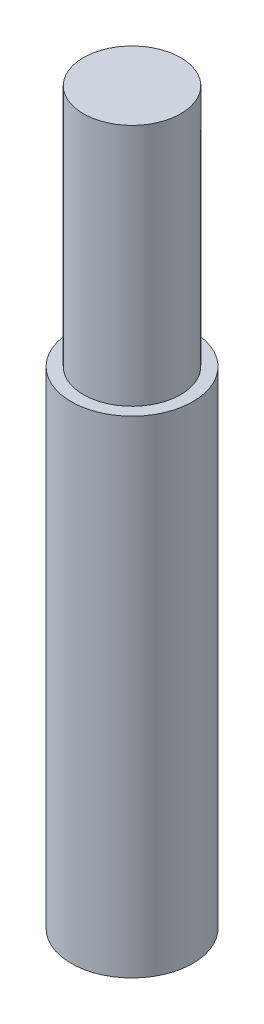
ISO-10303-21;
HEADER;
FILE_DESCRIPTION(('STEP AP214'),'2;1');
FILE_NAME('part.step','',(''),(''),'','','');
FILE_SCHEMA(('AUTOMOTIVE_DESIGN { 1 0 10303 214 1 1 1 1 }'));
ENDSEC;
DATA;
#1=APPLICATION_CONTEXT('core data for automotive mechanical design processes');
#2=APPLICATION_PROTOCOL_DEFINITION('international standard','automotive_design',2000,#1);
#3=PRODUCT_CONTEXT('',#1,'mechanical');
#4=PRODUCT('Part','Part','',(#3));
#5=PRODUCT_RELATED_PRODUCT_CATEGORY('part','',(#4));
#6=PRODUCT_DEFINITION_FORMATION('','',#4);
#7=PRODUCT_DEFINITION_CONTEXT('part definition',#1,'design');
#8=PRODUCT_DEFINITION('design','',#6,#7);
#9=PRODUCT_DEFINITION_SHAPE('','',#8);
#10=(LENGTH_UNIT() NAMED_UNIT(*) SI_UNIT(.MILLI.,.METRE.));
#11=(NAMED_UNIT(*) PLANE_ANGLE_UNIT() SI_UNIT($,.RADIAN.));
#12=(NAMED_UNIT(*) SI_UNIT($,.STERADIAN.) SOLID_ANGLE_UNIT());
#13=UNCERTAINTY_MEASURE_WITH_UNIT(LENGTH_MEASURE(1.E-05),#10,'distance_accuracy_value','');
#14=(GEOMETRIC_REPRESENTATION_CONTEXT(3) GLOBAL_UNCERTAINTY_ASSIGNED_CONTEXT((#13)) GLOBAL_UNIT_ASSIGNED_CONTEXT((#10,
#11,#12)) REPRESENTATION_CONTEXT('',''));
#15=CARTESIAN_POINT('',(0.,0.,0.));
#16=DIRECTION('',(0.,0.,1.));
#17=DIRECTION('',(1.,0.,0.));
#18=AXIS2_PLACEMENT_3D('',#15,#16,#17);
#19=CARTESIAN_POINT('',(0.,0.399999999999999,0.));
#20=DIRECTION('',(0.,-1.,0.));
#21=DIRECTION('',(0.,0.,-1.));
#22=AXIS2_PLACEMENT_3D('',#19,#20,#21);
#23=TOROIDAL_SURFACE('',#22,2.4,0.4);
#24=CARTESIAN_POINT('',(0.,0.,0.));
#25=DIRECTION('',(0.,-1.,0.));
#26=DIRECTION('',(0.,0.,-1.));
#27=AXIS2_PLACEMENT_3D('',#24,#25,#26);
#28=CIRCLE('',#27,2.4);
#29=CARTESIAN_POINT('',(0.,0.,-2.4));
#30=VERTEX_POINT('',#29);
#31=EDGE_CURVE('E38',#30,#30,#28,.F.);
#32=ORIENTED_EDGE('',*,*,#31,.F.);
#33=EDGE_LOOP('',(#32));
#34=FACE_BOUND('',#33,.T.);
#35=CARTESIAN_POINT('',(0.,0.399999999999999,0.));
#36=DIRECTION('',(0.,-1.,0.));
#37=DIRECTION('',(0.,0.,-1.));
#38=AXIS2_PLACEMENT_3D('',#35,#36,#37);
#39=CIRCLE('',#38,2.);
#40=CARTESIAN_POINT('',(0.,0.399999999999999,-2.));
#41=VERTEX_POINT('',#40);
#42=EDGE_CURVE('E10',#41,#41,#39,.T.);
#43=ORIENTED_EDGE('',*,*,#42,.F.);
#44=EDGE_LOOP('',(#43));
#45=FACE_BOUND('',#44,.T.);
#46=ADVANCED_FACE('F32',(#34,#45),#23,.T.);
#47=CARTESIAN_POINT('',(2.5,0.,0.));
#48=DIRECTION('',(0.,-1.,0.));
#49=DIRECTION('',(0.,0.,-1.));
#50=AXIS2_PLACEMENT_3D('',#47,#48,#49);
#51=PLANE('',#50);
#52=ORIENTED_EDGE('',*,*,#31,.T.);
#53=EDGE_LOOP('',(#52));
#54=FACE_BOUND('',#53,.T.);
#55=CARTESIAN_POINT('',(0.,0.,0.));
#56=DIRECTION('',(0.,-1.,0.));
#57=DIRECTION('',(0.,0.,-1.));
#58=AXIS2_PLACEMENT_3D('',#55,#56,#57);
#59=CIRCLE('',#58,2.5);
#60=CARTESIAN_POINT('',(0.,0.,-2.5));
#61=VERTEX_POINT('',#60);
#62=EDGE_CURVE('E54',#61,#61,#59,.T.);
#63=ORIENTED_EDGE('',*,*,#62,.T.);
#64=EDGE_LOOP('',(#63));
#65=FACE_BOUND('',#64,.T.);
#66=ADVANCED_FACE('F76',(#54,#65),#51,.T.);
#67=CARTESIAN_POINT('',(0.,30.,0.));
#68=DIRECTION('',(0.,1.,0.));
#69=DIRECTION('',(0.,0.,1.));
#70=AXIS2_PLACEMENT_3D('',#67,#68,#69);
#71=PLANE('',#70);
#72=CARTESIAN_POINT('',(0.,30.,0.));
#73=DIRECTION('',(0.,-1.,0.));
#74=DIRECTION('',(0.,0.,-1.));
#75=AXIS2_PLACEMENT_3D('',#72,#73,#74);
#76=CIRCLE('',#75,2.);
#77=CARTESIAN_POINT('',(0.,30.,-2.));
#78=VERTEX_POINT('',#77);
#79=EDGE_CURVE('E42',#78,#78,#76,.T.);
#80=ORIENTED_EDGE('',*,*,#79,.F.);
#81=EDGE_LOOP('',(#80));
#82=FACE_BOUND('',#81,.T.);
#83=ADVANCED_FACE('F81',(#82),#71,.T.);
#84=CARTESIAN_POINT('',(0.,0.,0.));
#85=DIRECTION('',(0.,-1.,0.));
#86=DIRECTION('',(0.,0.,-1.));
#87=AXIS2_PLACEMENT_3D('',#84,#85,#86);
#88=CYLINDRICAL_SURFACE('',#87,2.);
#89=ORIENTED_EDGE('',*,*,#79,.T.);
#90=EDGE_LOOP('',(#89));
#91=FACE_BOUND('',#90,.T.);
#92=CARTESIAN_POINT('',(0.,20.,0.));
#93=DIRECTION('',(0.,-1.,0.));
#94=DIRECTION('',(0.,0.,-1.));
#95=AXIS2_PLACEMENT_3D('',#92,#93,#94);
#96=CIRCLE('',#95,2.);
#97=CARTESIAN_POINT('',(0.,20.,-2.));
#98=VERTEX_POINT('',#97);
#99=EDGE_CURVE('E46',#98,#98,#96,.T.);
#100=ORIENTED_EDGE('',*,*,#99,.F.);
#101=EDGE_LOOP('',(#100));
#102=FACE_BOUND('',#101,.T.);
#103=ADVANCED_FACE('F86',(#91,#102),#88,.T.);
#104=CARTESIAN_POINT('',(2.,20.,0.));
#105=DIRECTION('',(0.,1.,0.));
#106=DIRECTION('',(0.,0.,1.));
#107=AXIS2_PLACEMENT_3D('',#104,#105,#106);
#108=PLANE('',#107);
#109=ORIENTED_EDGE('',*,*,#99,.T.);
#110=EDGE_LOOP('',(#109));
#111=FACE_BOUND('',#110,.T.);
#112=CARTESIAN_POINT('',(0.,20.,0.));
#113=DIRECTION('',(0.,-1.,0.));
#114=DIRECTION('',(0.,0.,-1.));
#115=AXIS2_PLACEMENT_3D('',#112,#113,#114);
#116=CIRCLE('',#115,2.5);
#117=CARTESIAN_POINT('',(0.,20.,-2.5));
#118=VERTEX_POINT('',#117);
#119=EDGE_CURVE('E51',#118,#118,#116,.T.);
#120=ORIENTED_EDGE('',*,*,#119,.F.);
#121=EDGE_LOOP('',(#120));
#122=FACE_BOUND('',#121,.T.);
#123=ADVANCED_FACE('F72',(#111,#122),#108,.T.);
#124=CARTESIAN_POINT('',(0.,0.,0.));
#125=DIRECTION('',(0.,-1.,0.));
#126=DIRECTION('',(0.,0.,-1.));
#127=AXIS2_PLACEMENT_3D('',#124,#125,#126);
#128=CYLINDRICAL_SURFACE('',#127,2.5);
#129=ORIENTED_EDGE('',*,*,#119,.T.);
#130=EDGE_LOOP('',(#129));
#131=FACE_BOUND('',#130,.T.);
#132=ORIENTED_EDGE('',*,*,#62,.F.);
#133=EDGE_LOOP('',(#132));
#134=FACE_BOUND('',#133,.T.);
#135=ADVANCED_FACE('F65',(#131,#134),#128,.T.);
#136=CARTESIAN_POINT('',(0.,10.,0.));
#137=DIRECTION('',(0.,-1.,0.));
#138=DIRECTION('',(0.,0.,-1.));
#139=AXIS2_PLACEMENT_3D('',#136,#137,#138);
#140=CYLINDRICAL_SURFACE('',#139,2.);
#141=ORIENTED_EDGE('',*,*,#42,.T.);
#142=EDGE_LOOP('',(#141));
#143=FACE_BOUND('',#142,.T.);
#144=CARTESIAN_POINT('',(0.,10.,0.));
#145=DIRECTION('',(0.,-1.,0.));
#146=DIRECTION('',(0.,0.,-1.));
#147=AXIS2_PLACEMENT_3D('',#144,#145,#146);
#148=CIRCLE('',#147,2.);
#149=CARTESIAN_POINT('',(0.,10.,-2.));
#150=VERTEX_POINT('',#149);
#151=EDGE_CURVE('E57',#150,#150,#148,.T.);
#152=ORIENTED_EDGE('',*,*,#151,.F.);
#153=EDGE_LOOP('',(#152));
#154=FACE_BOUND('',#153,.T.);
#155=ADVANCED_FACE('F63',(#143,#154),#140,.F.);
#156=CARTESIAN_POINT('',(0.,10.,0.));
#157=DIRECTION('',(0.,-1.,0.));
#158=DIRECTION('',(0.,0.,-1.));
#159=AXIS2_PLACEMENT_3D('',#156,#157,#158);
#160=PLANE('',#159);
#161=ORIENTED_EDGE('',*,*,#151,.T.);
#162=EDGE_LOOP('',(#161));
#163=FACE_BOUND('',#162,.T.);
#164=ADVANCED_FACE('F61',(#163),#160,.T.);
#165=CLOSED_SHELL('',(#46,#66,#83,#103,#123,#135,#155,#164));
#166=MANIFOLD_SOLID_BREP('B2',#165);
#167=ADVANCED_BREP_SHAPE_REPRESENTATION('',(#18,#166),#14);
#168=SHAPE_DEFINITION_REPRESENTATION(#9,#167);
ENDSEC;
END-ISO-10303-21;
